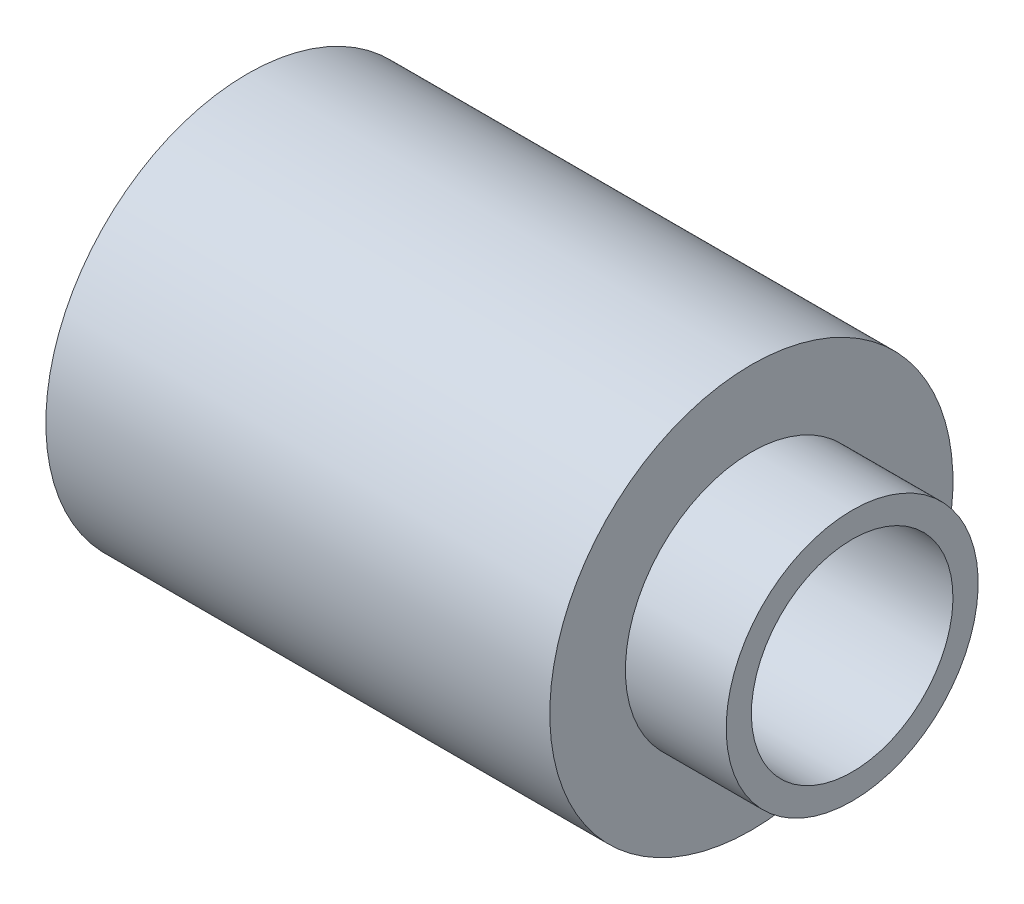
ISO-10303-21;
HEADER;
FILE_DESCRIPTION(('STEP AP214'),'2;1');
FILE_NAME('part.step','',(''),(''),'','','');
FILE_SCHEMA(('AUTOMOTIVE_DESIGN { 1 0 10303 214 1 1 1 1 }'));
ENDSEC;
DATA;
#1=APPLICATION_CONTEXT('core data for automotive mechanical design processes');
#2=APPLICATION_PROTOCOL_DEFINITION('international standard','automotive_design',2000,#1);
#3=PRODUCT_CONTEXT('',#1,'mechanical');
#4=PRODUCT('Part','Part','',(#3));
#5=PRODUCT_RELATED_PRODUCT_CATEGORY('part','',(#4));
#6=PRODUCT_DEFINITION_FORMATION('','',#4);
#7=PRODUCT_DEFINITION_CONTEXT('part definition',#1,'design');
#8=PRODUCT_DEFINITION('design','',#6,#7);
#9=PRODUCT_DEFINITION_SHAPE('','',#8);
#10=(LENGTH_UNIT() NAMED_UNIT(*) SI_UNIT(.MILLI.,.METRE.));
#11=(NAMED_UNIT(*) PLANE_ANGLE_UNIT() SI_UNIT($,.RADIAN.));
#12=(NAMED_UNIT(*) SI_UNIT($,.STERADIAN.) SOLID_ANGLE_UNIT());
#13=UNCERTAINTY_MEASURE_WITH_UNIT(LENGTH_MEASURE(1.E-05),#10,'distance_accuracy_value','');
#14=(GEOMETRIC_REPRESENTATION_CONTEXT(3) GLOBAL_UNCERTAINTY_ASSIGNED_CONTEXT((#13)) GLOBAL_UNIT_ASSIGNED_CONTEXT((#10,
#11,#12)) REPRESENTATION_CONTEXT('',''));
#15=CARTESIAN_POINT('',(0.,0.,0.));
#16=DIRECTION('',(0.,0.,1.));
#17=DIRECTION('',(1.,0.,0.));
#18=AXIS2_PLACEMENT_3D('',#15,#16,#17);
#19=CARTESIAN_POINT('',(0.,2.5,0.));
#20=DIRECTION('',(1.,0.,0.));
#21=DIRECTION('',(0.,1.,0.));
#22=AXIS2_PLACEMENT_3D('',#19,#20,#21);
#23=PLANE('',#22);
#24=CARTESIAN_POINT('',(0.,0.,0.));
#25=DIRECTION('',(1.,0.,0.));
#26=DIRECTION('',(0.,1.,0.));
#27=AXIS2_PLACEMENT_3D('',#24,#25,#26);
#28=CIRCLE('',#27,2.);
#29=CARTESIAN_POINT('',(0.,2.,0.));
#30=VERTEX_POINT('',#29);
#31=EDGE_CURVE('E57',#30,#30,#28,.T.);
#32=ORIENTED_EDGE('',*,*,#31,.F.);
#33=EDGE_LOOP('',(#32));
#34=FACE_BOUND('',#33,.T.);
#35=CARTESIAN_POINT('',(0.,0.,0.));
#36=DIRECTION('',(1.,0.,0.));
#37=DIRECTION('',(0.,1.,0.));
#38=AXIS2_PLACEMENT_3D('',#35,#36,#37);
#39=CIRCLE('',#38,2.5);
#40=CARTESIAN_POINT('',(0.,2.5,0.));
#41=VERTEX_POINT('',#40);
#42=EDGE_CURVE('E51',#41,#41,#39,.T.);
#43=ORIENTED_EDGE('',*,*,#42,.T.);
#44=EDGE_LOOP('',(#43));
#45=FACE_BOUND('',#44,.T.);
#46=ADVANCED_FACE('F37',(#34,#45),#23,.T.);
#47=CARTESIAN_POINT('',(-12.,0.,0.));
#48=DIRECTION('',(-1.,0.,0.));
#49=DIRECTION('',(0.,-1.,0.));
#50=AXIS2_PLACEMENT_3D('',#47,#48,#49);
#51=PLANE('',#50);
#52=CARTESIAN_POINT('',(-12.,0.,0.));
#53=DIRECTION('',(1.,0.,0.));
#54=DIRECTION('',(0.,1.,0.));
#55=AXIS2_PLACEMENT_3D('',#52,#53,#54);
#56=CIRCLE('',#55,2.);
#57=CARTESIAN_POINT('',(-12.,2.,0.));
#58=VERTEX_POINT('',#57);
#59=EDGE_CURVE('E56',#58,#58,#56,.T.);
#60=ORIENTED_EDGE('',*,*,#59,.T.);
#61=EDGE_LOOP('',(#60));
#62=FACE_BOUND('',#61,.T.);
#63=CARTESIAN_POINT('',(-12.,0.,0.));
#64=DIRECTION('',(1.,0.,0.));
#65=DIRECTION('',(0.,1.,0.));
#66=AXIS2_PLACEMENT_3D('',#63,#64,#65);
#67=CIRCLE('',#66,4.);
#68=CARTESIAN_POINT('',(-12.,4.,0.));
#69=VERTEX_POINT('',#68);
#70=EDGE_CURVE('E10',#69,#69,#67,.T.);
#71=ORIENTED_EDGE('',*,*,#70,.F.);
#72=EDGE_LOOP('',(#71));
#73=FACE_BOUND('',#72,.T.);
#74=ADVANCED_FACE('F63',(#62,#73),#51,.T.);
#75=CARTESIAN_POINT('',(0.,0.,0.));
#76=DIRECTION('',(1.,0.,0.));
#77=DIRECTION('',(0.,1.,0.));
#78=AXIS2_PLACEMENT_3D('',#75,#76,#77);
#79=CYLINDRICAL_SURFACE('',#78,4.);
#80=ORIENTED_EDGE('',*,*,#70,.T.);
#81=EDGE_LOOP('',(#80));
#82=FACE_BOUND('',#81,.T.);
#83=CARTESIAN_POINT('',(-2.,0.,0.));
#84=DIRECTION('',(1.,0.,0.));
#85=DIRECTION('',(0.,1.,0.));
#86=AXIS2_PLACEMENT_3D('',#83,#84,#85);
#87=CIRCLE('',#86,4.);
#88=CARTESIAN_POINT('',(-2.,4.,0.));
#89=VERTEX_POINT('',#88);
#90=EDGE_CURVE('E43',#89,#89,#87,.T.);
#91=ORIENTED_EDGE('',*,*,#90,.F.);
#92=EDGE_LOOP('',(#91));
#93=FACE_BOUND('',#92,.T.);
#94=ADVANCED_FACE('F84',(#82,#93),#79,.T.);
#95=CARTESIAN_POINT('',(-2.,4.,0.));
#96=DIRECTION('',(1.,0.,0.));
#97=DIRECTION('',(0.,1.,0.));
#98=AXIS2_PLACEMENT_3D('',#95,#96,#97);
#99=PLANE('',#98);
#100=ORIENTED_EDGE('',*,*,#90,.T.);
#101=EDGE_LOOP('',(#100));
#102=FACE_BOUND('',#101,.T.);
#103=CARTESIAN_POINT('',(-2.,0.,0.));
#104=DIRECTION('',(1.,0.,0.));
#105=DIRECTION('',(0.,1.,0.));
#106=AXIS2_PLACEMENT_3D('',#103,#104,#105);
#107=CIRCLE('',#106,2.5);
#108=CARTESIAN_POINT('',(-2.,2.5,0.));
#109=VERTEX_POINT('',#108);
#110=EDGE_CURVE('E47',#109,#109,#107,.T.);
#111=ORIENTED_EDGE('',*,*,#110,.F.);
#112=EDGE_LOOP('',(#111));
#113=FACE_BOUND('',#112,.T.);
#114=ADVANCED_FACE('F78',(#102,#113),#99,.T.);
#115=CARTESIAN_POINT('',(0.,0.,0.));
#116=DIRECTION('',(1.,0.,0.));
#117=DIRECTION('',(0.,1.,0.));
#118=AXIS2_PLACEMENT_3D('',#115,#116,#117);
#119=CYLINDRICAL_SURFACE('',#118,2.5);
#120=ORIENTED_EDGE('',*,*,#110,.T.);
#121=EDGE_LOOP('',(#120));
#122=FACE_BOUND('',#121,.T.);
#123=ORIENTED_EDGE('',*,*,#42,.F.);
#124=EDGE_LOOP('',(#123));
#125=FACE_BOUND('',#124,.T.);
#126=ADVANCED_FACE('F69',(#122,#125),#119,.T.);
#127=CARTESIAN_POINT('',(-12.,0.,0.));
#128=DIRECTION('',(1.,0.,0.));
#129=DIRECTION('',(0.,1.,0.));
#130=AXIS2_PLACEMENT_3D('',#127,#128,#129);
#131=CYLINDRICAL_SURFACE('',#130,2.);
#132=ORIENTED_EDGE('',*,*,#59,.F.);
#133=EDGE_LOOP('',(#132));
#134=FACE_BOUND('',#133,.T.);
#135=ORIENTED_EDGE('',*,*,#31,.T.);
#136=EDGE_LOOP('',(#135));
#137=FACE_BOUND('',#136,.T.);
#138=ADVANCED_FACE('F66',(#134,#137),#131,.F.);
#139=CLOSED_SHELL('',(#46,#74,#94,#114,#126,#138));
#140=MANIFOLD_SOLID_BREP('B2',#139);
#141=ADVANCED_BREP_SHAPE_REPRESENTATION('',(#18,#140),#14);
#142=SHAPE_DEFINITION_REPRESENTATION(#9,#141);
ENDSEC;
END-ISO-10303-21;
